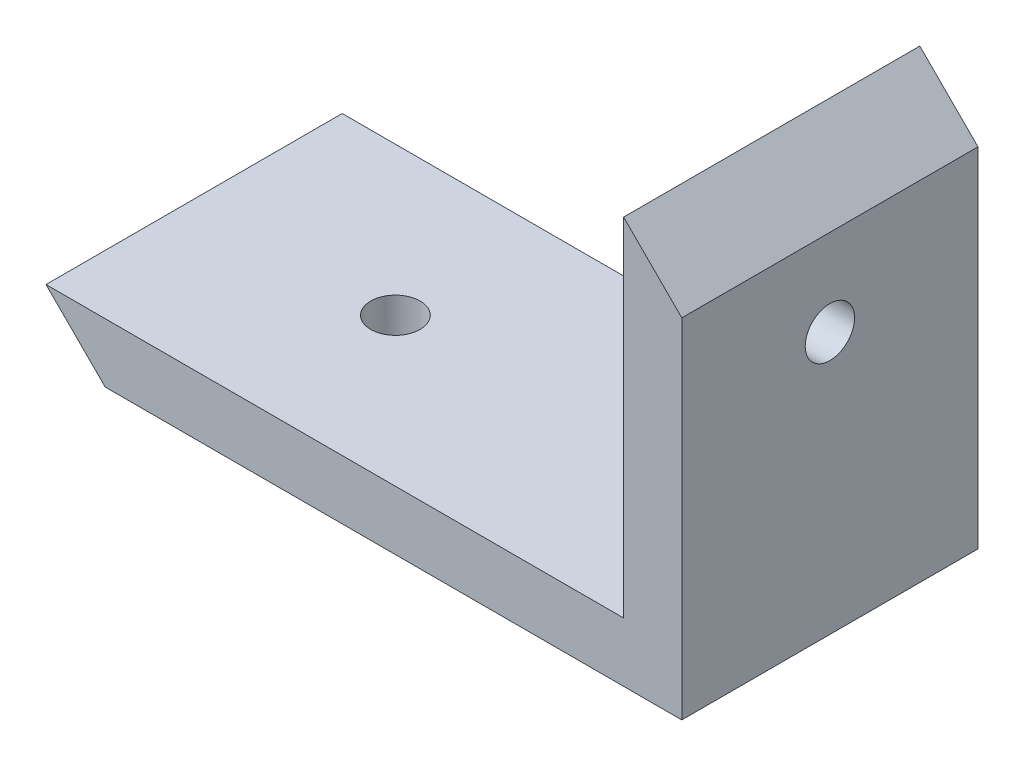
ISO-10303-21;
HEADER;
FILE_DESCRIPTION(('STEP AP214'),'2;1');
FILE_NAME('part.step','',(''),(''),'','','');
FILE_SCHEMA(('AUTOMOTIVE_DESIGN { 1 0 10303 214 1 1 1 1 }'));
ENDSEC;
DATA;
#1=APPLICATION_CONTEXT('core data for automotive mechanical design processes');
#2=APPLICATION_PROTOCOL_DEFINITION('international standard','automotive_design',2000,#1);
#3=PRODUCT_CONTEXT('',#1,'mechanical');
#4=PRODUCT('Part','Part','',(#3));
#5=PRODUCT_RELATED_PRODUCT_CATEGORY('part','',(#4));
#6=PRODUCT_DEFINITION_FORMATION('','',#4);
#7=PRODUCT_DEFINITION_CONTEXT('part definition',#1,'design');
#8=PRODUCT_DEFINITION('design','',#6,#7);
#9=PRODUCT_DEFINITION_SHAPE('','',#8);
#10=(LENGTH_UNIT() NAMED_UNIT(*) SI_UNIT(.MILLI.,.METRE.));
#11=(NAMED_UNIT(*) PLANE_ANGLE_UNIT() SI_UNIT($,.RADIAN.));
#12=(NAMED_UNIT(*) SI_UNIT($,.STERADIAN.) SOLID_ANGLE_UNIT());
#13=UNCERTAINTY_MEASURE_WITH_UNIT(LENGTH_MEASURE(1.E-05),#10,'distance_accuracy_value','');
#14=(GEOMETRIC_REPRESENTATION_CONTEXT(3) GLOBAL_UNCERTAINTY_ASSIGNED_CONTEXT((#13)) GLOBAL_UNIT_ASSIGNED_CONTEXT((#10,
#11,#12)) REPRESENTATION_CONTEXT('',''));
#15=CARTESIAN_POINT('',(0.,0.,0.));
#16=DIRECTION('',(0.,0.,1.));
#17=DIRECTION('',(1.,0.,0.));
#18=AXIS2_PLACEMENT_3D('',#15,#16,#17);
#19=CARTESIAN_POINT('',(32.9217228450065,30.,-12.0346045798601));
#20=DIRECTION('',(1.,0.,0.));
#21=DIRECTION('',(0.,0.,-1.));
#22=AXIS2_PLACEMENT_3D('',#19,#20,#21);
#23=PLANE('',#22);
#24=DIRECTION('',(0.,0.,1.));
#25=VECTOR('',#24,1.);
#26=CARTESIAN_POINT('',(32.9217228450065,21.1611652351682,-56.0346045798601));
#27=LINE('',#26,#25);
#28=CARTESIAN_POINT('',(32.9217228450065,21.1611652351682,-6.03460457986012));
#29=VERTEX_POINT('',#28);
#30=CARTESIAN_POINT('',(32.9217228450065,21.1611652351682,11.9653954201399));
#31=VERTEX_POINT('',#30);
#32=EDGE_CURVE('E143',#29,#31,#27,.T.);
#33=ORIENTED_EDGE('',*,*,#32,.T.);
#34=DIRECTION('',(0.,-1.,0.));
#35=VECTOR('',#34,1.);
#36=CARTESIAN_POINT('',(32.9217228450065,30.,11.9653954201399));
#37=LINE('',#36,#35);
#38=CARTESIAN_POINT('',(32.9217228450065,0.,11.9653954201399));
#39=VERTEX_POINT('',#38);
#40=EDGE_CURVE('E48',#31,#39,#37,.T.);
#41=ORIENTED_EDGE('',*,*,#40,.T.);
#42=DIRECTION('',(0.,0.,1.));
#43=VECTOR('',#42,1.);
#44=CARTESIAN_POINT('',(32.9217228450065,0.,-12.0346045798601));
#45=LINE('',#44,#43);
#46=CARTESIAN_POINT('',(32.9217228450065,0.,-6.03460457986012));
#47=VERTEX_POINT('',#46);
#48=EDGE_CURVE('E107',#47,#39,#45,.T.);
#49=ORIENTED_EDGE('',*,*,#48,.F.);
#50=DIRECTION('',(0.,1.,0.));
#51=VECTOR('',#50,1.);
#52=CARTESIAN_POINT('',(32.9217228450065,30.,-6.03460457986012));
#53=LINE('',#52,#51);
#54=EDGE_CURVE('E123',#47,#29,#53,.T.);
#55=ORIENTED_EDGE('',*,*,#54,.T.);
#56=EDGE_LOOP('',(#33,#41,#49,#55));
#57=FACE_BOUND('',#56,.T.);
#58=CARTESIAN_POINT('',(32.9217228450065,15.9149462359162,2.96539542013987));
#59=DIRECTION('',(1.,0.,0.));
#60=DIRECTION('',(0.,0.,-1.));
#61=AXIS2_PLACEMENT_3D('',#58,#59,#60);
#62=CIRCLE('',#61,1.5);
#63=CARTESIAN_POINT('',(32.9217228450065,15.9149462359162,1.46539542013987));
#64=VERTEX_POINT('',#63);
#65=EDGE_CURVE('E154',#64,#64,#62,.T.);
#66=ORIENTED_EDGE('',*,*,#65,.F.);
#67=EDGE_LOOP('',(#66));
#68=FACE_BOUND('',#67,.T.);
#69=ADVANCED_FACE('F45',(#57,#68),#23,.T.);
#70=CARTESIAN_POINT('',(0.,0.,0.));
#71=DIRECTION('',(0.,-1.,0.));
#72=DIRECTION('',(0.,0.,-1.));
#73=AXIS2_PLACEMENT_3D('',#70,#71,#72);
#74=PLANE('',#73);
#75=DIRECTION('',(0.,0.,1.));
#76=VECTOR('',#75,1.);
#77=CARTESIAN_POINT('',(-2.11606485256344,0.,-56.0346045798601));
#78=LINE('',#77,#76);
#79=CARTESIAN_POINT('',(-2.11606485256344,0.,-6.03460457986012));
#80=VERTEX_POINT('',#79);
#81=CARTESIAN_POINT('',(-2.11606485256344,0.,11.9653954201399));
#82=VERTEX_POINT('',#81);
#83=EDGE_CURVE('E79',#80,#82,#78,.T.);
#84=ORIENTED_EDGE('',*,*,#83,.F.);
#85=DIRECTION('',(1.,0.,0.));
#86=VECTOR('',#85,1.);
#87=CARTESIAN_POINT('',(-38.6138110609262,0.,-6.03460457986012));
#88=LINE('',#87,#86);
#89=EDGE_CURVE('E120',#80,#47,#88,.T.);
#90=ORIENTED_EDGE('',*,*,#89,.T.);
#91=ORIENTED_EDGE('',*,*,#48,.T.);
#92=DIRECTION('',(1.,0.,0.));
#93=VECTOR('',#92,1.);
#94=CARTESIAN_POINT('',(-38.6138110609262,0.,11.9653954201399));
#95=LINE('',#94,#93);
#96=EDGE_CURVE('E97',#82,#39,#95,.T.);
#97=ORIENTED_EDGE('',*,*,#96,.F.);
#98=EDGE_LOOP('',(#84,#90,#91,#97));
#99=FACE_BOUND('',#98,.T.);
#100=CARTESIAN_POINT('',(6.51938226980521,0.,2.96539542013988));
#101=DIRECTION('',(0.,-1.,0.));
#102=DIRECTION('',(0.,0.,-1.));
#103=AXIS2_PLACEMENT_3D('',#100,#101,#102);
#104=CIRCLE('',#103,1.5);
#105=CARTESIAN_POINT('',(6.51938226980521,0.,1.46539542013988));
#106=VERTEX_POINT('',#105);
#107=EDGE_CURVE('E115',#106,#106,#104,.T.);
#108=ORIENTED_EDGE('',*,*,#107,.F.);
#109=EDGE_LOOP('',(#108));
#110=FACE_BOUND('',#109,.T.);
#111=ADVANCED_FACE('F104',(#99,#110),#74,.T.);
#112=CARTESIAN_POINT('',(29.3861889390738,3.5976594247987,-50.0346045798601));
#113=DIRECTION('',(1.,0.,0.));
#114=DIRECTION('',(0.,0.,-1.));
#115=AXIS2_PLACEMENT_3D('',#112,#113,#114);
#116=PLANE('',#115);
#117=CARTESIAN_POINT('',(29.3861889390738,15.9149462359162,2.96539542013987));
#118=DIRECTION('',(-1.,0.,0.));
#119=DIRECTION('',(0.,0.,1.));
#120=AXIS2_PLACEMENT_3D('',#117,#118,#119);
#121=CIRCLE('',#120,1.5);
#122=CARTESIAN_POINT('',(29.3861889390738,15.9149462359162,4.46539542013987));
#123=VERTEX_POINT('',#122);
#124=EDGE_CURVE('E117',#123,#123,#121,.T.);
#125=ORIENTED_EDGE('',*,*,#124,.F.);
#126=EDGE_LOOP('',(#125));
#127=FACE_BOUND('',#126,.T.);
#128=DIRECTION('',(0.,-1.,0.));
#129=VECTOR('',#128,1.);
#130=CARTESIAN_POINT('',(29.3861889390738,3.59765942479871,11.9653954201399));
#131=LINE('',#130,#129);
#132=CARTESIAN_POINT('',(29.3861889390738,24.6966991411009,11.9653954201399));
#133=VERTEX_POINT('',#132);
#134=CARTESIAN_POINT('',(29.3861889390738,3.5976594247987,11.9653954201399));
#135=VERTEX_POINT('',#134);
#136=EDGE_CURVE('E110',#133,#135,#131,.T.);
#137=ORIENTED_EDGE('',*,*,#136,.F.);
#138=DIRECTION('',(0.,0.,1.));
#139=VECTOR('',#138,1.);
#140=CARTESIAN_POINT('',(29.3861889390738,24.6966991411009,-56.0346045798601));
#141=LINE('',#140,#139);
#142=CARTESIAN_POINT('',(29.3861889390738,24.6966991411009,-6.03460457986012));
#143=VERTEX_POINT('',#142);
#144=EDGE_CURVE('E11',#143,#133,#141,.T.);
#145=ORIENTED_EDGE('',*,*,#144,.F.);
#146=DIRECTION('',(0.,1.,0.));
#147=VECTOR('',#146,1.);
#148=CARTESIAN_POINT('',(29.3861889390738,3.5976594247987,-6.03460457986012));
#149=LINE('',#148,#147);
#150=CARTESIAN_POINT('',(29.3861889390738,3.5976594247987,-6.03460457986012));
#151=VERTEX_POINT('',#150);
#152=EDGE_CURVE('E109',#151,#143,#149,.T.);
#153=ORIENTED_EDGE('',*,*,#152,.F.);
#154=DIRECTION('',(0.,0.,1.));
#155=VECTOR('',#154,1.);
#156=CARTESIAN_POINT('',(29.3861889390738,3.5976594247987,-50.0346045798601));
#157=LINE('',#156,#155);
#158=EDGE_CURVE('E157',#151,#135,#157,.T.);
#159=ORIENTED_EDGE('',*,*,#158,.T.);
#160=EDGE_LOOP('',(#137,#145,#153,#159));
#161=FACE_BOUND('',#160,.T.);
#162=ADVANCED_FACE('F172',(#127,#161),#116,.F.);
#163=CARTESIAN_POINT('',(29.3861889390738,3.5976594247987,-50.0346045798601));
#164=DIRECTION('',(0.,1.,0.));
#165=DIRECTION('',(-1.,0.,0.));
#166=AXIS2_PLACEMENT_3D('',#163,#164,#165);
#167=PLANE('',#166);
#168=DIRECTION('',(0.,0.,-1.));
#169=VECTOR('',#168,1.);
#170=CARTESIAN_POINT('',(-5.71372427736212,3.59765942479869,11.9653954201399));
#171=LINE('',#170,#169);
#172=CARTESIAN_POINT('',(-5.71372427736212,3.59765942479869,11.9653954201399));
#173=VERTEX_POINT('',#172);
#174=CARTESIAN_POINT('',(-5.71372427736212,3.59765942479869,-6.03460457986012));
#175=VERTEX_POINT('',#174);
#176=EDGE_CURVE('E54',#173,#175,#171,.T.);
#177=ORIENTED_EDGE('',*,*,#176,.F.);
#178=DIRECTION('',(1.,0.,0.));
#179=VECTOR('',#178,1.);
#180=CARTESIAN_POINT('',(29.3861889390738,3.5976594247987,11.9653954201399));
#181=LINE('',#180,#179);
#182=EDGE_CURVE('E101',#173,#135,#181,.T.);
#183=ORIENTED_EDGE('',*,*,#182,.T.);
#184=ORIENTED_EDGE('',*,*,#158,.F.);
#185=DIRECTION('',(-1.,0.,0.));
#186=VECTOR('',#185,1.);
#187=CARTESIAN_POINT('',(29.3861889390738,3.5976594247987,-6.03460457986012));
#188=LINE('',#187,#186);
#189=EDGE_CURVE('E150',#151,#175,#188,.T.);
#190=ORIENTED_EDGE('',*,*,#189,.T.);
#191=EDGE_LOOP('',(#177,#183,#184,#190));
#192=FACE_BOUND('',#191,.T.);
#193=CARTESIAN_POINT('',(6.51938226980521,3.5976594247987,2.96539542013988));
#194=DIRECTION('',(0.,1.,0.));
#195=DIRECTION('',(-1.,0.,0.));
#196=AXIS2_PLACEMENT_3D('',#193,#194,#195);
#197=CIRCLE('',#196,1.5);
#198=CARTESIAN_POINT('',(5.01938226980521,3.5976594247987,2.96539542013988));
#199=VERTEX_POINT('',#198);
#200=EDGE_CURVE('E127',#199,#199,#197,.T.);
#201=ORIENTED_EDGE('',*,*,#200,.F.);
#202=EDGE_LOOP('',(#201));
#203=FACE_BOUND('',#202,.T.);
#204=ADVANCED_FACE('F175',(#192,#203),#167,.T.);
#205=CARTESIAN_POINT('',(97.3861889390738,15.9149462359162,2.96539542013987));
#206=DIRECTION('',(-1.,0.,0.));
#207=DIRECTION('',(0.,0.,1.));
#208=AXIS2_PLACEMENT_3D('',#205,#206,#207);
#209=CYLINDRICAL_SURFACE('',#208,1.5);
#210=ORIENTED_EDGE('',*,*,#65,.T.);
#211=EDGE_LOOP('',(#210));
#212=FACE_BOUND('',#211,.T.);
#213=ORIENTED_EDGE('',*,*,#124,.T.);
#214=EDGE_LOOP('',(#213));
#215=FACE_BOUND('',#214,.T.);
#216=ADVANCED_FACE('F170',(#212,#215),#209,.F.);
#217=CARTESIAN_POINT('',(-38.6138110609262,30.,11.9653954201399));
#218=DIRECTION('',(0.,0.,1.));
#219=DIRECTION('',(0.,-1.,0.));
#220=AXIS2_PLACEMENT_3D('',#217,#218,#219);
#221=PLANE('',#220);
#222=DIRECTION('',(0.707106781186547,-0.707106781186549,0.));
#223=VECTOR('',#222,1.);
#224=CARTESIAN_POINT('',(29.3861889390738,24.6966991411009,11.9653954201399));
#225=LINE('',#224,#223);
#226=EDGE_CURVE('E146',#133,#31,#225,.T.);
#227=ORIENTED_EDGE('',*,*,#226,.F.);
#228=ORIENTED_EDGE('',*,*,#136,.T.);
#229=ORIENTED_EDGE('',*,*,#182,.F.);
#230=DIRECTION('',(-0.707106781186546,0.707106781186549,0.));
#231=VECTOR('',#230,1.);
#232=CARTESIAN_POINT('',(-5.71372427736212,3.59765942479869,11.9653954201399));
#233=LINE('',#232,#231);
#234=EDGE_CURVE('E82',#82,#173,#233,.T.);
#235=ORIENTED_EDGE('',*,*,#234,.F.);
#236=ORIENTED_EDGE('',*,*,#96,.T.);
#237=ORIENTED_EDGE('',*,*,#40,.F.);
#238=EDGE_LOOP('',(#227,#228,#229,#235,#236,#237));
#239=FACE_BOUND('',#238,.T.);
#240=ADVANCED_FACE('F94',(#239),#221,.T.);
#241=CARTESIAN_POINT('',(-38.6138110609262,30.,-6.03460457986012));
#242=DIRECTION('',(0.,0.,-1.));
#243=DIRECTION('',(0.,1.,0.));
#244=AXIS2_PLACEMENT_3D('',#241,#242,#243);
#245=PLANE('',#244);
#246=DIRECTION('',(-0.707106781186547,0.707106781186549,0.));
#247=VECTOR('',#246,1.);
#248=CARTESIAN_POINT('',(-7.26546149037567,61.3483495705505,-6.03460457986013));
#249=LINE('',#248,#247);
#250=EDGE_CURVE('E61',#29,#143,#249,.T.);
#251=ORIENTED_EDGE('',*,*,#250,.F.);
#252=ORIENTED_EDGE('',*,*,#54,.F.);
#253=ORIENTED_EDGE('',*,*,#89,.F.);
#254=DIRECTION('',(0.707106781186546,-0.707106781186549,0.));
#255=VECTOR('',#254,1.);
#256=CARTESIAN_POINT('',(-35.3649379567448,33.2488731041814,-6.03460457986012));
#257=LINE('',#256,#255);
#258=EDGE_CURVE('E83',#175,#80,#257,.T.);
#259=ORIENTED_EDGE('',*,*,#258,.F.);
#260=ORIENTED_EDGE('',*,*,#189,.F.);
#261=ORIENTED_EDGE('',*,*,#152,.T.);
#262=EDGE_LOOP('',(#251,#252,#253,#259,#260,#261));
#263=FACE_BOUND('',#262,.T.);
#264=ADVANCED_FACE('F191',(#263),#245,.T.);
#265=CARTESIAN_POINT('',(6.51938226980522,-64.4023405752013,2.96539542013988));
#266=DIRECTION('',(0.,1.,0.));
#267=DIRECTION('',(-1.,0.,0.));
#268=AXIS2_PLACEMENT_3D('',#265,#266,#267);
#269=CYLINDRICAL_SURFACE('',#268,1.5);
#270=ORIENTED_EDGE('',*,*,#107,.T.);
#271=EDGE_LOOP('',(#270));
#272=FACE_BOUND('',#271,.T.);
#273=ORIENTED_EDGE('',*,*,#200,.T.);
#274=EDGE_LOOP('',(#273));
#275=FACE_BOUND('',#274,.T.);
#276=ADVANCED_FACE('F212',(#272,#275),#269,.F.);
#277=CARTESIAN_POINT('',(-5.71372427736212,3.59765942479869,-56.0346045798601));
#278=DIRECTION('',(0.707106781186549,0.707106781186546,0.));
#279=DIRECTION('',(-0.707106781186546,0.707106781186549,0.));
#280=AXIS2_PLACEMENT_3D('',#277,#278,#279);
#281=PLANE('',#280);
#282=ORIENTED_EDGE('',*,*,#258,.T.);
#283=ORIENTED_EDGE('',*,*,#83,.T.);
#284=ORIENTED_EDGE('',*,*,#234,.T.);
#285=ORIENTED_EDGE('',*,*,#176,.T.);
#286=EDGE_LOOP('',(#282,#283,#284,#285));
#287=FACE_BOUND('',#286,.T.);
#288=ADVANCED_FACE('F81',(#287),#281,.F.);
#289=CARTESIAN_POINT('',(29.3861889390738,24.6966991411009,-56.0346045798601));
#290=DIRECTION('',(-0.707106781186549,-0.707106781186547,0.));
#291=DIRECTION('',(0.707106781186547,-0.707106781186549,0.));
#292=AXIS2_PLACEMENT_3D('',#289,#290,#291);
#293=PLANE('',#292);
#294=ORIENTED_EDGE('',*,*,#250,.T.);
#295=ORIENTED_EDGE('',*,*,#144,.T.);
#296=ORIENTED_EDGE('',*,*,#226,.T.);
#297=ORIENTED_EDGE('',*,*,#32,.F.);
#298=EDGE_LOOP('',(#294,#295,#296,#297));
#299=FACE_BOUND('',#298,.T.);
#300=ADVANCED_FACE('F196',(#299),#293,.F.);
#301=CLOSED_SHELL('',(#69,#111,#162,#204,#216,#240,#264,#276,#288,#300));
#302=MANIFOLD_SOLID_BREP('B2',#301);
#303=ADVANCED_BREP_SHAPE_REPRESENTATION('',(#18,#302),#14);
#304=SHAPE_DEFINITION_REPRESENTATION(#9,#303);
ENDSEC;
END-ISO-10303-21;
